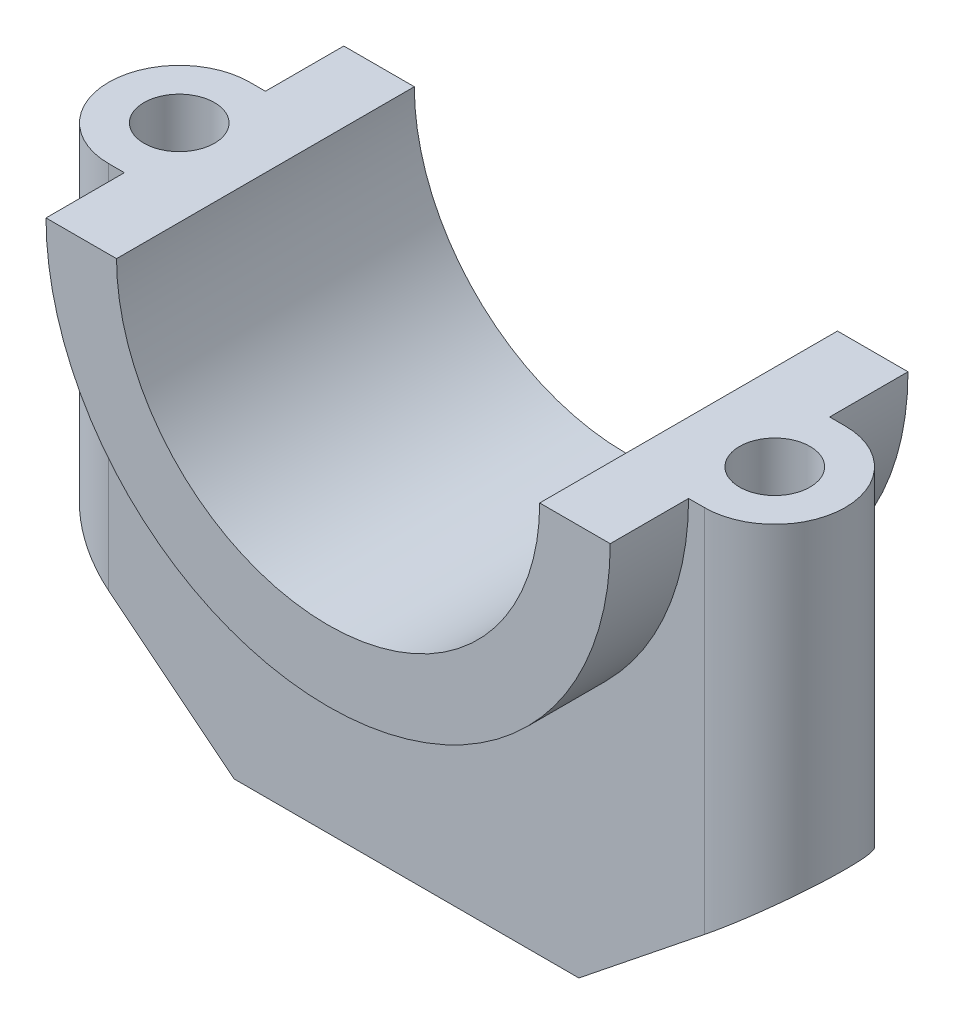
ISO-10303-21;
HEADER;
FILE_DESCRIPTION(('STEP AP214'),'2;1');
FILE_NAME('part.step','',(''),(''),'','','');
FILE_SCHEMA(('AUTOMOTIVE_DESIGN { 1 0 10303 214 1 1 1 1 }'));
ENDSEC;
DATA;
#1=APPLICATION_CONTEXT('core data for automotive mechanical design processes');
#2=APPLICATION_PROTOCOL_DEFINITION('international standard','automotive_design',2000,#1);
#3=PRODUCT_CONTEXT('',#1,'mechanical');
#4=PRODUCT('Part','Part','',(#3));
#5=PRODUCT_RELATED_PRODUCT_CATEGORY('part','',(#4));
#6=PRODUCT_DEFINITION_FORMATION('','',#4);
#7=PRODUCT_DEFINITION_CONTEXT('part definition',#1,'design');
#8=PRODUCT_DEFINITION('design','',#6,#7);
#9=PRODUCT_DEFINITION_SHAPE('','',#8);
#10=(LENGTH_UNIT() NAMED_UNIT(*) SI_UNIT(.MILLI.,.METRE.));
#11=(NAMED_UNIT(*) PLANE_ANGLE_UNIT() SI_UNIT($,.RADIAN.));
#12=(NAMED_UNIT(*) SI_UNIT($,.STERADIAN.) SOLID_ANGLE_UNIT());
#13=UNCERTAINTY_MEASURE_WITH_UNIT(LENGTH_MEASURE(1.E-05),#10,'distance_accuracy_value','');
#14=(GEOMETRIC_REPRESENTATION_CONTEXT(3) GLOBAL_UNCERTAINTY_ASSIGNED_CONTEXT((#13)) GLOBAL_UNIT_ASSIGNED_CONTEXT((#10,
#11,#12)) REPRESENTATION_CONTEXT('',''));
#15=CARTESIAN_POINT('',(0.,0.,0.));
#16=DIRECTION('',(0.,0.,1.));
#17=DIRECTION('',(1.,0.,0.));
#18=AXIS2_PLACEMENT_3D('',#15,#16,#17);
#19=CARTESIAN_POINT('',(27.,0.,38.));
#20=DIRECTION('',(0.,1.,0.));
#21=DIRECTION('',(-1.,0.,0.));
#22=AXIS2_PLACEMENT_3D('',#19,#20,#21);
#23=PLANE('',#22);
#24=CARTESIAN_POINT('',(-38.,0.,19.));
#25=DIRECTION('',(0.,1.,0.));
#26=DIRECTION('',(-1.,0.,0.));
#27=AXIS2_PLACEMENT_3D('',#24,#25,#26);
#28=CIRCLE('',#27,4.5);
#29=CARTESIAN_POINT('',(-42.5,0.,19.));
#30=VERTEX_POINT('',#29);
#31=EDGE_CURVE('E204',#30,#30,#28,.T.);
#32=ORIENTED_EDGE('',*,*,#31,.F.);
#33=EDGE_LOOP('',(#32));
#34=FACE_BOUND('',#33,.T.);
#35=DIRECTION('',(0.,0.,1.));
#36=VECTOR('',#35,1.);
#37=CARTESIAN_POINT('',(-27.,0.,-2.));
#38=LINE('',#37,#36);
#39=CARTESIAN_POINT('',(-27.,0.,0.));
#40=VERTEX_POINT('',#39);
#41=CARTESIAN_POINT('',(-27.,0.,38.));
#42=VERTEX_POINT('',#41);
#43=EDGE_CURVE('E146',#40,#42,#38,.T.);
#44=ORIENTED_EDGE('',*,*,#43,.F.);
#45=DIRECTION('',(1.,0.,0.));
#46=VECTOR('',#45,1.);
#47=CARTESIAN_POINT('',(27.,0.,0.));
#48=LINE('',#47,#46);
#49=CARTESIAN_POINT('',(-36.,0.,0.));
#50=VERTEX_POINT('',#49);
#51=EDGE_CURVE('E174',#50,#40,#48,.T.);
#52=ORIENTED_EDGE('',*,*,#51,.F.);
#53=DIRECTION('',(0.,0.,-1.));
#54=VECTOR('',#53,1.);
#55=CARTESIAN_POINT('',(-36.,0.,38.));
#56=LINE('',#55,#54);
#57=CARTESIAN_POINT('',(-36.,0.,10.));
#58=VERTEX_POINT('',#57);
#59=EDGE_CURVE('E190',#58,#50,#56,.T.);
#60=ORIENTED_EDGE('',*,*,#59,.F.);
#61=DIRECTION('',(-1.,0.,0.));
#62=VECTOR('',#61,1.);
#63=CARTESIAN_POINT('',(-36.,0.,10.));
#64=LINE('',#63,#62);
#65=CARTESIAN_POINT('',(-38.,0.,10.));
#66=VERTEX_POINT('',#65);
#67=EDGE_CURVE('E266',#58,#66,#64,.T.);
#68=ORIENTED_EDGE('',*,*,#67,.T.);
#69=CARTESIAN_POINT('',(-38.,0.,19.));
#70=DIRECTION('',(0.,-1.,0.));
#71=DIRECTION('',(1.,0.,0.));
#72=AXIS2_PLACEMENT_3D('',#69,#70,#71);
#73=CIRCLE('',#72,9.);
#74=CARTESIAN_POINT('',(-38.,0.,28.));
#75=VERTEX_POINT('',#74);
#76=EDGE_CURVE('E79',#75,#66,#73,.T.);
#77=ORIENTED_EDGE('',*,*,#76,.F.);
#78=DIRECTION('',(-1.,0.,0.));
#79=VECTOR('',#78,1.);
#80=CARTESIAN_POINT('',(-36.,0.,28.));
#81=LINE('',#80,#79);
#82=CARTESIAN_POINT('',(-36.,0.,28.));
#83=VERTEX_POINT('',#82);
#84=EDGE_CURVE('E244',#83,#75,#81,.T.);
#85=ORIENTED_EDGE('',*,*,#84,.F.);
#86=CARTESIAN_POINT('',(-36.,0.,38.));
#87=VERTEX_POINT('',#86);
#88=EDGE_CURVE('E186',#87,#83,#56,.T.);
#89=ORIENTED_EDGE('',*,*,#88,.F.);
#90=DIRECTION('',(1.,0.,0.));
#91=VECTOR('',#90,1.);
#92=CARTESIAN_POINT('',(-36.,0.,38.));
#93=LINE('',#92,#91);
#94=EDGE_CURVE('E167',#87,#42,#93,.T.);
#95=ORIENTED_EDGE('',*,*,#94,.T.);
#96=EDGE_LOOP('',(#44,#52,#60,#68,#77,#85,#89,#95));
#97=FACE_BOUND('',#96,.T.);
#98=ADVANCED_FACE('F54',(#34,#97),#23,.T.);
#99=CARTESIAN_POINT('',(38.,0.,19.));
#100=DIRECTION('',(0.,1.,0.));
#101=DIRECTION('',(-1.,0.,0.));
#102=AXIS2_PLACEMENT_3D('',#99,#100,#101);
#103=CIRCLE('',#102,4.5);
#104=CARTESIAN_POINT('',(33.5,0.,19.));
#105=VERTEX_POINT('',#104);
#106=EDGE_CURVE('E212',#105,#105,#103,.T.);
#107=ORIENTED_EDGE('',*,*,#106,.F.);
#108=EDGE_LOOP('',(#107));
#109=FACE_BOUND('',#108,.T.);
#110=DIRECTION('',(0.,0.,1.));
#111=VECTOR('',#110,1.);
#112=CARTESIAN_POINT('',(27.,0.,-2.));
#113=LINE('',#112,#111);
#114=CARTESIAN_POINT('',(27.,0.,0.));
#115=VERTEX_POINT('',#114);
#116=CARTESIAN_POINT('',(27.,0.,38.));
#117=VERTEX_POINT('',#116);
#118=EDGE_CURVE('E72',#115,#117,#113,.T.);
#119=ORIENTED_EDGE('',*,*,#118,.T.);
#120=CARTESIAN_POINT('',(36.,0.,38.));
#121=VERTEX_POINT('',#120);
#122=EDGE_CURVE('E156',#117,#121,#93,.T.);
#123=ORIENTED_EDGE('',*,*,#122,.T.);
#124=DIRECTION('',(0.,0.,-1.));
#125=VECTOR('',#124,1.);
#126=CARTESIAN_POINT('',(36.,0.,38.));
#127=LINE('',#126,#125);
#128=CARTESIAN_POINT('',(36.,0.,28.));
#129=VERTEX_POINT('',#128);
#130=EDGE_CURVE('E191',#121,#129,#127,.T.);
#131=ORIENTED_EDGE('',*,*,#130,.T.);
#132=DIRECTION('',(-1.,0.,0.));
#133=VECTOR('',#132,1.);
#134=CARTESIAN_POINT('',(36.,0.,28.));
#135=LINE('',#134,#133);
#136=CARTESIAN_POINT('',(38.,0.,28.));
#137=VERTEX_POINT('',#136);
#138=EDGE_CURVE('E259',#137,#129,#135,.T.);
#139=ORIENTED_EDGE('',*,*,#138,.F.);
#140=CARTESIAN_POINT('',(38.,0.,19.));
#141=DIRECTION('',(0.,1.,0.));
#142=DIRECTION('',(-1.,0.,0.));
#143=AXIS2_PLACEMENT_3D('',#140,#141,#142);
#144=CIRCLE('',#143,9.);
#145=CARTESIAN_POINT('',(38.,0.,10.));
#146=VERTEX_POINT('',#145);
#147=EDGE_CURVE('E222',#137,#146,#144,.T.);
#148=ORIENTED_EDGE('',*,*,#147,.T.);
#149=DIRECTION('',(-1.,0.,0.));
#150=VECTOR('',#149,1.);
#151=CARTESIAN_POINT('',(36.,0.,10.));
#152=LINE('',#151,#150);
#153=CARTESIAN_POINT('',(36.,0.,10.));
#154=VERTEX_POINT('',#153);
#155=EDGE_CURVE('E245',#146,#154,#152,.T.);
#156=ORIENTED_EDGE('',*,*,#155,.T.);
#157=CARTESIAN_POINT('',(36.,0.,0.));
#158=VERTEX_POINT('',#157);
#159=EDGE_CURVE('E182',#154,#158,#127,.T.);
#160=ORIENTED_EDGE('',*,*,#159,.T.);
#161=EDGE_CURVE('E159',#115,#158,#48,.T.);
#162=ORIENTED_EDGE('',*,*,#161,.F.);
#163=EDGE_LOOP('',(#119,#123,#131,#139,#148,#156,#160,#162));
#164=FACE_BOUND('',#163,.T.);
#165=ADVANCED_FACE('F56',(#109,#164),#23,.T.);
#166=CARTESIAN_POINT('',(0.,0.,10.));
#167=DIRECTION('',(0.,0.,1.));
#168=DIRECTION('',(1.,0.,0.));
#169=AXIS2_PLACEMENT_3D('',#166,#167,#168);
#170=PLANE('',#169);
#171=DIRECTION('',(0.,1.,0.));
#172=VECTOR('',#171,1.);
#173=CARTESIAN_POINT('',(38.,-60.,10.));
#174=LINE('',#173,#172);
#175=CARTESIAN_POINT('',(38.,-47.2,10.));
#176=VERTEX_POINT('',#175);
#177=EDGE_CURVE('E227',#176,#146,#174,.T.);
#178=ORIENTED_EDGE('',*,*,#177,.F.);
#179=DIRECTION('',(0.780868809443029,0.624695047554427,0.));
#180=VECTOR('',#179,1.);
#181=CARTESIAN_POINT('',(47.0000000000003,-39.9999999999998,10.));
#182=LINE('',#181,#180);
#183=CARTESIAN_POINT('',(22.0000000000004,-59.9999999999998,10.));
#184=VERTEX_POINT('',#183);
#185=EDGE_CURVE('E276',#184,#176,#182,.T.);
#186=ORIENTED_EDGE('',*,*,#185,.F.);
#187=DIRECTION('',(1.,0.,0.));
#188=VECTOR('',#187,1.);
#189=CARTESIAN_POINT('',(-22.,-59.9999999999999,10.));
#190=LINE('',#189,#188);
#191=CARTESIAN_POINT('',(-22.,-59.9999999999999,10.));
#192=VERTEX_POINT('',#191);
#193=EDGE_CURVE('E273',#192,#184,#190,.T.);
#194=ORIENTED_EDGE('',*,*,#193,.F.);
#195=DIRECTION('',(0.78086880944303,-0.624695047554425,0.));
#196=VECTOR('',#195,1.);
#197=CARTESIAN_POINT('',(-47.,-40.,10.));
#198=LINE('',#197,#196);
#199=CARTESIAN_POINT('',(-38.,-47.2,10.));
#200=VERTEX_POINT('',#199);
#201=EDGE_CURVE('E270',#200,#192,#198,.T.);
#202=ORIENTED_EDGE('',*,*,#201,.F.);
#203=DIRECTION('',(0.,1.,0.));
#204=VECTOR('',#203,1.);
#205=CARTESIAN_POINT('',(-38.,-60.0000000000001,10.));
#206=LINE('',#205,#204);
#207=EDGE_CURVE('E189',#66,#200,#206,.F.);
#208=ORIENTED_EDGE('',*,*,#207,.F.);
#209=ORIENTED_EDGE('',*,*,#67,.F.);
#210=CARTESIAN_POINT('',(0.,0.,10.));
#211=DIRECTION('',(0.,0.,-1.));
#212=DIRECTION('',(1.,0.,0.));
#213=AXIS2_PLACEMENT_3D('',#210,#211,#212);
#214=CIRCLE('',#213,36.);
#215=EDGE_CURVE('E239',#154,#58,#214,.T.);
#216=ORIENTED_EDGE('',*,*,#215,.F.);
#217=ORIENTED_EDGE('',*,*,#155,.F.);
#218=EDGE_LOOP('',(#178,#186,#194,#202,#208,#209,#216,#217));
#219=FACE_BOUND('',#218,.T.);
#220=ADVANCED_FACE('F322',(#219),#170,.F.);
#221=CARTESIAN_POINT('',(47.0000000000003,-39.9999999999998,28.));
#222=DIRECTION('',(-0.624695047554427,0.780868809443029,0.));
#223=DIRECTION('',(-0.780868809443029,-0.624695047554427,0.));
#224=AXIS2_PLACEMENT_3D('',#221,#222,#223);
#225=PLANE('',#224);
#226=CARTESIAN_POINT('',(38.,-47.2,19.));
#227=DIRECTION('',(-0.624695047554427,0.780868809443029,0.));
#228=DIRECTION('',(0.780868809443029,0.624695047554427,0.));
#229=AXIS2_PLACEMENT_3D('',#226,#227,#228);
#230=ELLIPSE('',#229,5.76281181368957,4.5);
#231=CARTESIAN_POINT('',(42.5,-43.5999999999999,19.));
#232=VERTEX_POINT('',#231);
#233=EDGE_CURVE('E58',#232,#232,#230,.T.);
#234=ORIENTED_EDGE('',*,*,#233,.T.);
#235=EDGE_LOOP('',(#234));
#236=FACE_BOUND('',#235,.T.);
#237=CARTESIAN_POINT('',(38.,-47.2,19.));
#238=DIRECTION('',(-0.624695047554427,0.780868809443029,0.));
#239=DIRECTION('',(0.780868809443029,0.624695047554427,0.));
#240=AXIS2_PLACEMENT_3D('',#237,#238,#239);
#241=ELLIPSE('',#240,11.5256236273792,9.);
#242=CARTESIAN_POINT('',(38.,-47.2,28.));
#243=VERTEX_POINT('',#242);
#244=EDGE_CURVE('E230',#243,#176,#241,.T.);
#245=ORIENTED_EDGE('',*,*,#244,.F.);
#246=DIRECTION('',(0.780868809443029,0.624695047554427,0.));
#247=VECTOR('',#246,1.);
#248=CARTESIAN_POINT('',(47.0000000000003,-39.9999999999998,28.));
#249=LINE('',#248,#247);
#250=CARTESIAN_POINT('',(22.0000000000004,-59.9999999999998,28.));
#251=VERTEX_POINT('',#250);
#252=EDGE_CURVE('E255',#251,#243,#249,.T.);
#253=ORIENTED_EDGE('',*,*,#252,.F.);
#254=DIRECTION('',(0.,0.,-1.));
#255=VECTOR('',#254,1.);
#256=CARTESIAN_POINT('',(22.0000000000004,-59.9999999999998,28.));
#257=LINE('',#256,#255);
#258=EDGE_CURVE('E262',#251,#184,#257,.T.);
#259=ORIENTED_EDGE('',*,*,#258,.T.);
#260=ORIENTED_EDGE('',*,*,#185,.T.);
#261=EDGE_LOOP('',(#245,#253,#259,#260));
#262=FACE_BOUND('',#261,.T.);
#263=ADVANCED_FACE('F323',(#236,#262),#225,.F.);
#264=CARTESIAN_POINT('',(-47.,-40.,28.));
#265=DIRECTION('',(0.624695047554425,0.780868809443031,0.));
#266=DIRECTION('',(-0.780868809443031,0.624695047554425,0.));
#267=AXIS2_PLACEMENT_3D('',#264,#265,#266);
#268=PLANE('',#267);
#269=CARTESIAN_POINT('',(-38.,-47.2,19.));
#270=DIRECTION('',(0.624695047554425,0.780868809443031,0.));
#271=DIRECTION('',(-0.780868809443031,0.624695047554425,0.));
#272=AXIS2_PLACEMENT_3D('',#269,#270,#271);
#273=ELLIPSE('',#272,5.76281181368956,4.5);
#274=CARTESIAN_POINT('',(-42.5,-43.6,19.));
#275=VERTEX_POINT('',#274);
#276=EDGE_CURVE('E201',#275,#275,#273,.T.);
#277=ORIENTED_EDGE('',*,*,#276,.T.);
#278=EDGE_LOOP('',(#277));
#279=FACE_BOUND('',#278,.T.);
#280=DIRECTION('',(0.78086880944303,-0.624695047554425,0.));
#281=VECTOR('',#280,1.);
#282=CARTESIAN_POINT('',(-47.,-40.,28.));
#283=LINE('',#282,#281);
#284=CARTESIAN_POINT('',(-38.,-47.2,28.));
#285=VERTEX_POINT('',#284);
#286=CARTESIAN_POINT('',(-22.,-59.9999999999999,28.));
#287=VERTEX_POINT('',#286);
#288=EDGE_CURVE('E249',#285,#287,#283,.T.);
#289=ORIENTED_EDGE('',*,*,#288,.F.);
#290=CARTESIAN_POINT('',(-38.,-47.2,19.));
#291=DIRECTION('',(0.624695047554425,0.780868809443031,0.));
#292=DIRECTION('',(-0.780868809443031,0.624695047554425,0.));
#293=AXIS2_PLACEMENT_3D('',#290,#291,#292);
#294=ELLIPSE('',#293,11.5256236273791,9.);
#295=EDGE_CURVE('E235',#285,#200,#294,.F.);
#296=ORIENTED_EDGE('',*,*,#295,.T.);
#297=ORIENTED_EDGE('',*,*,#201,.T.);
#298=DIRECTION('',(0.,0.,-1.));
#299=VECTOR('',#298,1.);
#300=CARTESIAN_POINT('',(-22.,-59.9999999999999,28.));
#301=LINE('',#300,#299);
#302=EDGE_CURVE('E178',#287,#192,#301,.T.);
#303=ORIENTED_EDGE('',*,*,#302,.F.);
#304=EDGE_LOOP('',(#289,#296,#297,#303));
#305=FACE_BOUND('',#304,.T.);
#306=ADVANCED_FACE('F325',(#279,#305),#268,.F.);
#307=CARTESIAN_POINT('',(0.,0.,38.));
#308=DIRECTION('',(0.,0.,-1.));
#309=DIRECTION('',(-1.,0.,0.));
#310=AXIS2_PLACEMENT_3D('',#307,#308,#309);
#311=CYLINDRICAL_SURFACE('',#310,36.);
#312=ORIENTED_EDGE('',*,*,#215,.T.);
#313=ORIENTED_EDGE('',*,*,#59,.T.);
#314=CARTESIAN_POINT('',(0.,0.,0.));
#315=DIRECTION('',(0.,0.,1.));
#316=DIRECTION('',(1.,0.,0.));
#317=AXIS2_PLACEMENT_3D('',#314,#315,#316);
#318=CIRCLE('',#317,36.);
#319=EDGE_CURVE('E168',#50,#158,#318,.T.);
#320=ORIENTED_EDGE('',*,*,#319,.T.);
#321=ORIENTED_EDGE('',*,*,#159,.F.);
#322=EDGE_LOOP('',(#312,#313,#320,#321));
#323=FACE_BOUND('',#322,.T.);
#324=ADVANCED_FACE('F305',(#323),#311,.T.);
#325=ORIENTED_EDGE('',*,*,#88,.T.);
#326=CARTESIAN_POINT('',(0.,0.,28.));
#327=DIRECTION('',(0.,0.,-1.));
#328=DIRECTION('',(1.,0.,0.));
#329=AXIS2_PLACEMENT_3D('',#326,#327,#328);
#330=CIRCLE('',#329,36.);
#331=EDGE_CURVE('E240',#129,#83,#330,.T.);
#332=ORIENTED_EDGE('',*,*,#331,.F.);
#333=ORIENTED_EDGE('',*,*,#130,.F.);
#334=CARTESIAN_POINT('',(0.,0.,38.));
#335=DIRECTION('',(0.,0.,1.));
#336=DIRECTION('',(1.,0.,0.));
#337=AXIS2_PLACEMENT_3D('',#334,#335,#336);
#338=CIRCLE('',#337,36.);
#339=EDGE_CURVE('E164',#87,#121,#338,.T.);
#340=ORIENTED_EDGE('',*,*,#339,.F.);
#341=EDGE_LOOP('',(#325,#332,#333,#340));
#342=FACE_BOUND('',#341,.T.);
#343=ADVANCED_FACE('F313',(#342),#311,.T.);
#344=CARTESIAN_POINT('',(0.,0.,38.));
#345=DIRECTION('',(0.,0.,1.));
#346=DIRECTION('',(1.,0.,0.));
#347=AXIS2_PLACEMENT_3D('',#344,#345,#346);
#348=PLANE('',#347);
#349=CARTESIAN_POINT('',(0.,0.,38.));
#350=DIRECTION('',(0.,0.,1.));
#351=DIRECTION('',(1.,0.,0.));
#352=AXIS2_PLACEMENT_3D('',#349,#350,#351);
#353=CIRCLE('',#352,27.);
#354=EDGE_CURVE('E143',#42,#117,#353,.T.);
#355=ORIENTED_EDGE('',*,*,#354,.F.);
#356=ORIENTED_EDGE('',*,*,#94,.F.);
#357=ORIENTED_EDGE('',*,*,#339,.T.);
#358=ORIENTED_EDGE('',*,*,#122,.F.);
#359=EDGE_LOOP('',(#355,#356,#357,#358));
#360=FACE_BOUND('',#359,.T.);
#361=ADVANCED_FACE('F162',(#360),#348,.T.);
#362=CARTESIAN_POINT('',(0.,0.,0.));
#363=DIRECTION('',(0.,0.,1.));
#364=DIRECTION('',(1.,0.,0.));
#365=AXIS2_PLACEMENT_3D('',#362,#363,#364);
#366=PLANE('',#365);
#367=ORIENTED_EDGE('',*,*,#51,.T.);
#368=CARTESIAN_POINT('',(0.,0.,0.));
#369=DIRECTION('',(0.,0.,1.));
#370=DIRECTION('',(1.,0.,0.));
#371=AXIS2_PLACEMENT_3D('',#368,#369,#370);
#372=CIRCLE('',#371,27.);
#373=EDGE_CURVE('E13',#40,#115,#372,.T.);
#374=ORIENTED_EDGE('',*,*,#373,.T.);
#375=ORIENTED_EDGE('',*,*,#161,.T.);
#376=ORIENTED_EDGE('',*,*,#319,.F.);
#377=EDGE_LOOP('',(#367,#374,#375,#376));
#378=FACE_BOUND('',#377,.T.);
#379=ADVANCED_FACE('F299',(#378),#366,.F.);
#380=CARTESIAN_POINT('',(-22.,-59.9999999999999,28.));
#381=DIRECTION('',(0.,1.,0.));
#382=DIRECTION('',(-1.,0.,0.));
#383=AXIS2_PLACEMENT_3D('',#380,#381,#382);
#384=PLANE('',#383);
#385=ORIENTED_EDGE('',*,*,#193,.T.);
#386=ORIENTED_EDGE('',*,*,#258,.F.);
#387=DIRECTION('',(1.,0.,0.));
#388=VECTOR('',#387,1.);
#389=CARTESIAN_POINT('',(-22.,-59.9999999999999,28.));
#390=LINE('',#389,#388);
#391=EDGE_CURVE('E252',#287,#251,#390,.T.);
#392=ORIENTED_EDGE('',*,*,#391,.F.);
#393=ORIENTED_EDGE('',*,*,#302,.T.);
#394=EDGE_LOOP('',(#385,#386,#392,#393));
#395=FACE_BOUND('',#394,.T.);
#396=ADVANCED_FACE('F364',(#395),#384,.F.);
#397=CARTESIAN_POINT('',(0.,0.,28.));
#398=DIRECTION('',(0.,0.,1.));
#399=DIRECTION('',(1.,0.,0.));
#400=AXIS2_PLACEMENT_3D('',#397,#398,#399);
#401=PLANE('',#400);
#402=DIRECTION('',(0.,1.,0.));
#403=VECTOR('',#402,1.);
#404=CARTESIAN_POINT('',(38.,-60.,28.));
#405=LINE('',#404,#403);
#406=EDGE_CURVE('E64',#137,#243,#405,.F.);
#407=ORIENTED_EDGE('',*,*,#406,.F.);
#408=ORIENTED_EDGE('',*,*,#138,.T.);
#409=ORIENTED_EDGE('',*,*,#331,.T.);
#410=ORIENTED_EDGE('',*,*,#84,.T.);
#411=DIRECTION('',(0.,1.,0.));
#412=VECTOR('',#411,1.);
#413=CARTESIAN_POINT('',(-38.,-60.0000000000001,28.));
#414=LINE('',#413,#412);
#415=EDGE_CURVE('E196',#285,#75,#414,.T.);
#416=ORIENTED_EDGE('',*,*,#415,.F.);
#417=ORIENTED_EDGE('',*,*,#288,.T.);
#418=ORIENTED_EDGE('',*,*,#391,.T.);
#419=ORIENTED_EDGE('',*,*,#252,.T.);
#420=EDGE_LOOP('',(#407,#408,#409,#410,#416,#417,#418,#419));
#421=FACE_BOUND('',#420,.T.);
#422=ADVANCED_FACE('F317',(#421),#401,.T.);
#423=CARTESIAN_POINT('',(-38.,-60.0000000000001,19.));
#424=DIRECTION('',(0.,1.,0.));
#425=DIRECTION('',(-1.,0.,0.));
#426=AXIS2_PLACEMENT_3D('',#423,#424,#425);
#427=CYLINDRICAL_SURFACE('',#426,9.);
#428=ORIENTED_EDGE('',*,*,#295,.F.);
#429=ORIENTED_EDGE('',*,*,#415,.T.);
#430=ORIENTED_EDGE('',*,*,#76,.T.);
#431=ORIENTED_EDGE('',*,*,#207,.T.);
#432=EDGE_LOOP('',(#428,#429,#430,#431));
#433=FACE_BOUND('',#432,.T.);
#434=ADVANCED_FACE('F360',(#433),#427,.T.);
#435=CARTESIAN_POINT('',(38.,-60.,19.));
#436=DIRECTION('',(0.,1.,0.));
#437=DIRECTION('',(-1.,0.,0.));
#438=AXIS2_PLACEMENT_3D('',#435,#436,#437);
#439=CYLINDRICAL_SURFACE('',#438,9.);
#440=ORIENTED_EDGE('',*,*,#244,.T.);
#441=ORIENTED_EDGE('',*,*,#177,.T.);
#442=ORIENTED_EDGE('',*,*,#147,.F.);
#443=ORIENTED_EDGE('',*,*,#406,.T.);
#444=EDGE_LOOP('',(#440,#441,#442,#443));
#445=FACE_BOUND('',#444,.T.);
#446=ADVANCED_FACE('F319',(#445),#439,.T.);
#447=CARTESIAN_POINT('',(0.,0.,-2.));
#448=DIRECTION('',(0.,0.,1.));
#449=DIRECTION('',(1.,0.,0.));
#450=AXIS2_PLACEMENT_3D('',#447,#448,#449);
#451=CYLINDRICAL_SURFACE('',#450,27.);
#452=ORIENTED_EDGE('',*,*,#43,.T.);
#453=ORIENTED_EDGE('',*,*,#354,.T.);
#454=ORIENTED_EDGE('',*,*,#118,.F.);
#455=ORIENTED_EDGE('',*,*,#373,.F.);
#456=EDGE_LOOP('',(#452,#453,#454,#455));
#457=FACE_BOUND('',#456,.T.);
#458=ADVANCED_FACE('F144',(#457),#451,.F.);
#459=CARTESIAN_POINT('',(-38.,-60.0000000000001,19.));
#460=DIRECTION('',(0.,1.,0.));
#461=DIRECTION('',(-1.,0.,0.));
#462=AXIS2_PLACEMENT_3D('',#459,#460,#461);
#463=CYLINDRICAL_SURFACE('',#462,4.5);
#464=ORIENTED_EDGE('',*,*,#31,.T.);
#465=EDGE_LOOP('',(#464));
#466=FACE_BOUND('',#465,.T.);
#467=ORIENTED_EDGE('',*,*,#276,.F.);
#468=EDGE_LOOP('',(#467));
#469=FACE_BOUND('',#468,.T.);
#470=ADVANCED_FACE('F348',(#466,#469),#463,.F.);
#471=CARTESIAN_POINT('',(38.,-60.,19.));
#472=DIRECTION('',(0.,1.,0.));
#473=DIRECTION('',(-1.,0.,0.));
#474=AXIS2_PLACEMENT_3D('',#471,#472,#473);
#475=CYLINDRICAL_SURFACE('',#474,4.5);
#476=ORIENTED_EDGE('',*,*,#106,.T.);
#477=EDGE_LOOP('',(#476));
#478=FACE_BOUND('',#477,.T.);
#479=ORIENTED_EDGE('',*,*,#233,.F.);
#480=EDGE_LOOP('',(#479));
#481=FACE_BOUND('',#480,.T.);
#482=ADVANCED_FACE('F345',(#478,#481),#475,.F.);
#483=CLOSED_SHELL('',(#98,#165,#220,#263,#306,#324,#343,#361,#379,#396,#422,#434,#446,#458,#470,#482));
#484=MANIFOLD_SOLID_BREP('B2',#483);
#485=ADVANCED_BREP_SHAPE_REPRESENTATION('',(#18,#484),#14);
#486=SHAPE_DEFINITION_REPRESENTATION(#9,#485);
ENDSEC;
END-ISO-10303-21;
